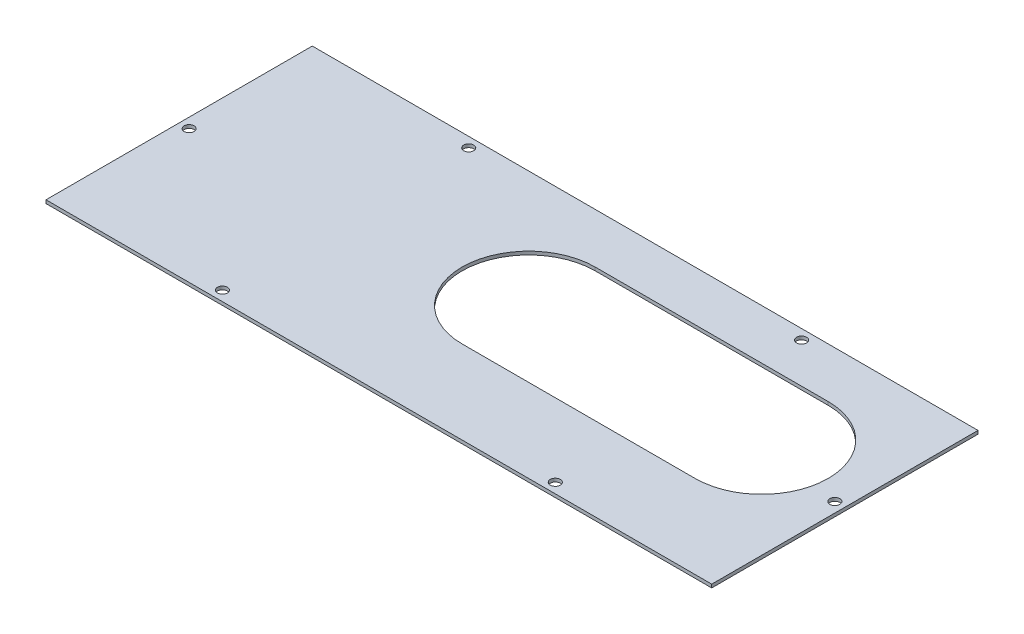
ISO-10303-21;
HEADER;
FILE_DESCRIPTION(('STEP AP214'),'2;1');
FILE_NAME('part.step','',(''),(''),'','','');
FILE_SCHEMA(('AUTOMOTIVE_DESIGN { 1 0 10303 214 1 1 1 1 }'));
ENDSEC;
DATA;
#1=APPLICATION_CONTEXT('core data for automotive mechanical design processes');
#2=APPLICATION_PROTOCOL_DEFINITION('international standard','automotive_design',2000,#1);
#3=PRODUCT_CONTEXT('',#1,'mechanical');
#4=PRODUCT('Part','Part','',(#3));
#5=PRODUCT_RELATED_PRODUCT_CATEGORY('part','',(#4));
#6=PRODUCT_DEFINITION_FORMATION('','',#4);
#7=PRODUCT_DEFINITION_CONTEXT('part definition',#1,'design');
#8=PRODUCT_DEFINITION('design','',#6,#7);
#9=PRODUCT_DEFINITION_SHAPE('','',#8);
#10=(LENGTH_UNIT() NAMED_UNIT(*) SI_UNIT(.MILLI.,.METRE.));
#11=(NAMED_UNIT(*) PLANE_ANGLE_UNIT() SI_UNIT($,.RADIAN.));
#12=(NAMED_UNIT(*) SI_UNIT($,.STERADIAN.) SOLID_ANGLE_UNIT());
#13=UNCERTAINTY_MEASURE_WITH_UNIT(LENGTH_MEASURE(1.E-05),#10,'distance_accuracy_value','');
#14=(GEOMETRIC_REPRESENTATION_CONTEXT(3) GLOBAL_UNCERTAINTY_ASSIGNED_CONTEXT((#13)) GLOBAL_UNIT_ASSIGNED_CONTEXT((#10,
#11,#12)) REPRESENTATION_CONTEXT('',''));
#15=CARTESIAN_POINT('',(0.,0.,0.));
#16=DIRECTION('',(0.,0.,1.));
#17=DIRECTION('',(1.,0.,0.));
#18=AXIS2_PLACEMENT_3D('',#15,#16,#17);
#19=CARTESIAN_POINT('',(-100.,1.,-40.));
#20=DIRECTION('',(1.,0.,0.));
#21=DIRECTION('',(0.,0.,-1.));
#22=AXIS2_PLACEMENT_3D('',#19,#20,#21);
#23=PLANE('',#22);
#24=DIRECTION('',(0.,0.,1.));
#25=VECTOR('',#24,1.);
#26=CARTESIAN_POINT('',(-100.,0.,-40.));
#27=LINE('',#26,#25);
#28=CARTESIAN_POINT('',(-100.,0.,-40.));
#29=VERTEX_POINT('',#28);
#30=CARTESIAN_POINT('',(-100.,0.,40.));
#31=VERTEX_POINT('',#30);
#32=EDGE_CURVE('E115',#29,#31,#27,.T.);
#33=ORIENTED_EDGE('',*,*,#32,.T.);
#34=DIRECTION('',(0.,-1.,0.));
#35=VECTOR('',#34,1.);
#36=CARTESIAN_POINT('',(-100.,1.,40.));
#37=LINE('',#36,#35);
#38=CARTESIAN_POINT('',(-100.,1.,40.));
#39=VERTEX_POINT('',#38);
#40=EDGE_CURVE('E11',#39,#31,#37,.T.);
#41=ORIENTED_EDGE('',*,*,#40,.F.);
#42=DIRECTION('',(0.,0.,1.));
#43=VECTOR('',#42,1.);
#44=CARTESIAN_POINT('',(-100.,1.,-40.));
#45=LINE('',#44,#43);
#46=CARTESIAN_POINT('',(-100.,1.,-40.));
#47=VERTEX_POINT('',#46);
#48=EDGE_CURVE('E138',#47,#39,#45,.T.);
#49=ORIENTED_EDGE('',*,*,#48,.F.);
#50=DIRECTION('',(0.,-1.,0.));
#51=VECTOR('',#50,1.);
#52=CARTESIAN_POINT('',(-100.,1.,-40.));
#53=LINE('',#52,#51);
#54=EDGE_CURVE('E148',#47,#29,#53,.T.);
#55=ORIENTED_EDGE('',*,*,#54,.T.);
#56=EDGE_LOOP('',(#33,#41,#49,#55));
#57=FACE_BOUND('',#56,.T.);
#58=ADVANCED_FACE('F35',(#57),#23,.F.);
#59=CARTESIAN_POINT('',(-100.,1.,40.));
#60=DIRECTION('',(0.,0.,-1.));
#61=DIRECTION('',(-1.,0.,0.));
#62=AXIS2_PLACEMENT_3D('',#59,#60,#61);
#63=PLANE('',#62);
#64=DIRECTION('',(1.,0.,0.));
#65=VECTOR('',#64,1.);
#66=CARTESIAN_POINT('',(-100.,0.,40.));
#67=LINE('',#66,#65);
#68=CARTESIAN_POINT('',(100.,0.,40.));
#69=VERTEX_POINT('',#68);
#70=EDGE_CURVE('E151',#31,#69,#67,.T.);
#71=ORIENTED_EDGE('',*,*,#70,.T.);
#72=DIRECTION('',(0.,-1.,0.));
#73=VECTOR('',#72,1.);
#74=CARTESIAN_POINT('',(100.,1.,40.));
#75=LINE('',#74,#73);
#76=CARTESIAN_POINT('',(100.,1.,40.));
#77=VERTEX_POINT('',#76);
#78=EDGE_CURVE('E43',#77,#69,#75,.T.);
#79=ORIENTED_EDGE('',*,*,#78,.F.);
#80=DIRECTION('',(1.,0.,0.));
#81=VECTOR('',#80,1.);
#82=CARTESIAN_POINT('',(-100.,1.,40.));
#83=LINE('',#82,#81);
#84=EDGE_CURVE('E141',#39,#77,#83,.T.);
#85=ORIENTED_EDGE('',*,*,#84,.F.);
#86=ORIENTED_EDGE('',*,*,#40,.T.);
#87=EDGE_LOOP('',(#71,#79,#85,#86));
#88=FACE_BOUND('',#87,.T.);
#89=ADVANCED_FACE('F219',(#88),#63,.F.);
#90=CARTESIAN_POINT('',(100.,1.,-40.));
#91=DIRECTION('',(-1.,0.,0.));
#92=DIRECTION('',(0.,0.,1.));
#93=AXIS2_PLACEMENT_3D('',#90,#91,#92);
#94=PLANE('',#93);
#95=DIRECTION('',(0.,0.,-1.));
#96=VECTOR('',#95,1.);
#97=CARTESIAN_POINT('',(100.,0.,-40.));
#98=LINE('',#97,#96);
#99=CARTESIAN_POINT('',(100.,0.,-40.));
#100=VERTEX_POINT('',#99);
#101=EDGE_CURVE('E153',#69,#100,#98,.T.);
#102=ORIENTED_EDGE('',*,*,#101,.T.);
#103=DIRECTION('',(0.,-1.,0.));
#104=VECTOR('',#103,1.);
#105=CARTESIAN_POINT('',(100.,1.,-40.));
#106=LINE('',#105,#104);
#107=CARTESIAN_POINT('',(100.,1.,-40.));
#108=VERTEX_POINT('',#107);
#109=EDGE_CURVE('E158',#108,#100,#106,.T.);
#110=ORIENTED_EDGE('',*,*,#109,.F.);
#111=DIRECTION('',(0.,0.,-1.));
#112=VECTOR('',#111,1.);
#113=CARTESIAN_POINT('',(100.,1.,-40.));
#114=LINE('',#113,#112);
#115=EDGE_CURVE('E144',#77,#108,#114,.T.);
#116=ORIENTED_EDGE('',*,*,#115,.F.);
#117=ORIENTED_EDGE('',*,*,#78,.T.);
#118=EDGE_LOOP('',(#102,#110,#116,#117));
#119=FACE_BOUND('',#118,.T.);
#120=ADVANCED_FACE('F224',(#119),#94,.F.);
#121=CARTESIAN_POINT('',(-100.,1.,-40.));
#122=DIRECTION('',(0.,0.,1.));
#123=DIRECTION('',(1.,0.,0.));
#124=AXIS2_PLACEMENT_3D('',#121,#122,#123);
#125=PLANE('',#124);
#126=DIRECTION('',(-1.,0.,0.));
#127=VECTOR('',#126,1.);
#128=CARTESIAN_POINT('',(-100.,0.,-40.));
#129=LINE('',#128,#127);
#130=EDGE_CURVE('E142',#100,#29,#129,.T.);
#131=ORIENTED_EDGE('',*,*,#130,.T.);
#132=ORIENTED_EDGE('',*,*,#54,.F.);
#133=DIRECTION('',(-1.,0.,0.));
#134=VECTOR('',#133,1.);
#135=CARTESIAN_POINT('',(-100.,1.,-40.));
#136=LINE('',#135,#134);
#137=EDGE_CURVE('E146',#108,#47,#136,.T.);
#138=ORIENTED_EDGE('',*,*,#137,.F.);
#139=ORIENTED_EDGE('',*,*,#109,.T.);
#140=EDGE_LOOP('',(#131,#132,#138,#139));
#141=FACE_BOUND('',#140,.T.);
#142=ADVANCED_FACE('F206',(#141),#125,.F.);
#143=CARTESIAN_POINT('',(0.,1.,0.));
#144=DIRECTION('',(0.,1.,0.));
#145=DIRECTION('',(0.,0.,1.));
#146=AXIS2_PLACEMENT_3D('',#143,#144,#145);
#147=PLANE('',#146);
#148=CARTESIAN_POINT('',(97.,1.,0.));
#149=DIRECTION('',(0.,1.,0.));
#150=DIRECTION('',(0.,0.,1.));
#151=AXIS2_PLACEMENT_3D('',#148,#149,#150);
#152=CIRCLE('',#151,1.5);
#153=CARTESIAN_POINT('',(97.,1.,1.5));
#154=VERTEX_POINT('',#153);
#155=EDGE_CURVE('E190',#154,#154,#152,.T.);
#156=ORIENTED_EDGE('',*,*,#155,.F.);
#157=EDGE_LOOP('',(#156));
#158=FACE_BOUND('',#157,.T.);
#159=CARTESIAN_POINT('',(-97.,1.,0.));
#160=DIRECTION('',(0.,1.,0.));
#161=DIRECTION('',(0.,0.,1.));
#162=AXIS2_PLACEMENT_3D('',#159,#160,#161);
#163=CIRCLE('',#162,1.5);
#164=CARTESIAN_POINT('',(-97.,1.,1.5));
#165=VERTEX_POINT('',#164);
#166=EDGE_CURVE('E180',#165,#165,#163,.T.);
#167=ORIENTED_EDGE('',*,*,#166,.F.);
#168=EDGE_LOOP('',(#167));
#169=FACE_BOUND('',#168,.T.);
#170=CARTESIAN_POINT('',(-50.,1.,37.));
#171=DIRECTION('',(0.,1.,0.));
#172=DIRECTION('',(0.,0.,1.));
#173=AXIS2_PLACEMENT_3D('',#170,#171,#172);
#174=CIRCLE('',#173,1.5);
#175=CARTESIAN_POINT('',(-50.,1.,38.5));
#176=VERTEX_POINT('',#175);
#177=EDGE_CURVE('E177',#176,#176,#174,.T.);
#178=ORIENTED_EDGE('',*,*,#177,.F.);
#179=EDGE_LOOP('',(#178));
#180=FACE_BOUND('',#179,.T.);
#181=CARTESIAN_POINT('',(50.,1.,37.));
#182=DIRECTION('',(0.,1.,0.));
#183=DIRECTION('',(0.,0.,1.));
#184=AXIS2_PLACEMENT_3D('',#181,#182,#183);
#185=CIRCLE('',#184,1.5);
#186=CARTESIAN_POINT('',(50.,1.,38.5));
#187=VERTEX_POINT('',#186);
#188=EDGE_CURVE('E174',#187,#187,#185,.T.);
#189=ORIENTED_EDGE('',*,*,#188,.F.);
#190=EDGE_LOOP('',(#189));
#191=FACE_BOUND('',#190,.T.);
#192=CARTESIAN_POINT('',(50.,1.,-37.));
#193=DIRECTION('',(0.,1.,0.));
#194=DIRECTION('',(0.,0.,1.));
#195=AXIS2_PLACEMENT_3D('',#192,#193,#194);
#196=CIRCLE('',#195,1.5);
#197=CARTESIAN_POINT('',(50.,1.,-35.5));
#198=VERTEX_POINT('',#197);
#199=EDGE_CURVE('E170',#198,#198,#196,.T.);
#200=ORIENTED_EDGE('',*,*,#199,.F.);
#201=EDGE_LOOP('',(#200));
#202=FACE_BOUND('',#201,.T.);
#203=CARTESIAN_POINT('',(-50.,1.,-37.));
#204=DIRECTION('',(0.,1.,0.));
#205=DIRECTION('',(0.,0.,1.));
#206=AXIS2_PLACEMENT_3D('',#203,#204,#205);
#207=CIRCLE('',#206,1.5);
#208=CARTESIAN_POINT('',(-50.,1.,-35.5));
#209=VERTEX_POINT('',#208);
#210=EDGE_CURVE('E166',#209,#209,#207,.T.);
#211=ORIENTED_EDGE('',*,*,#210,.F.);
#212=EDGE_LOOP('',(#211));
#213=FACE_BOUND('',#212,.T.);
#214=CARTESIAN_POINT('',(0.,1.,-5.));
#215=DIRECTION('',(0.,1.,0.));
#216=DIRECTION('',(0.,0.,1.));
#217=AXIS2_PLACEMENT_3D('',#214,#215,#216);
#218=CIRCLE('',#217,20.);
#219=CARTESIAN_POINT('',(0.,1.,-25.));
#220=VERTEX_POINT('',#219);
#221=CARTESIAN_POINT('',(0.,1.,15.));
#222=VERTEX_POINT('',#221);
#223=EDGE_CURVE('E51',#220,#222,#218,.T.);
#224=ORIENTED_EDGE('',*,*,#223,.F.);
#225=DIRECTION('',(-1.,0.,0.));
#226=VECTOR('',#225,1.);
#227=CARTESIAN_POINT('',(0.,1.,-25.));
#228=LINE('',#227,#226);
#229=CARTESIAN_POINT('',(70.,1.,-25.));
#230=VERTEX_POINT('',#229);
#231=EDGE_CURVE('E109',#230,#220,#228,.T.);
#232=ORIENTED_EDGE('',*,*,#231,.F.);
#233=CARTESIAN_POINT('',(70.,1.,-5.));
#234=DIRECTION('',(0.,1.,0.));
#235=DIRECTION('',(0.,0.,1.));
#236=AXIS2_PLACEMENT_3D('',#233,#234,#235);
#237=CIRCLE('',#236,20.);
#238=CARTESIAN_POINT('',(70.,1.,15.));
#239=VERTEX_POINT('',#238);
#240=EDGE_CURVE('E129',#239,#230,#237,.T.);
#241=ORIENTED_EDGE('',*,*,#240,.F.);
#242=DIRECTION('',(1.,0.,0.));
#243=VECTOR('',#242,1.);
#244=CARTESIAN_POINT('',(0.,1.,15.));
#245=LINE('',#244,#243);
#246=EDGE_CURVE('E123',#222,#239,#245,.T.);
#247=ORIENTED_EDGE('',*,*,#246,.F.);
#248=EDGE_LOOP('',(#224,#232,#241,#247));
#249=FACE_BOUND('',#248,.T.);
#250=ORIENTED_EDGE('',*,*,#48,.T.);
#251=ORIENTED_EDGE('',*,*,#84,.T.);
#252=ORIENTED_EDGE('',*,*,#115,.T.);
#253=ORIENTED_EDGE('',*,*,#137,.T.);
#254=EDGE_LOOP('',(#250,#251,#252,#253));
#255=FACE_BOUND('',#254,.T.);
#256=ADVANCED_FACE('F203',(#158,#169,#180,#191,#202,#213,#249,#255),#147,.T.);
#257=CARTESIAN_POINT('',(0.,0.,0.));
#258=DIRECTION('',(0.,1.,0.));
#259=DIRECTION('',(0.,0.,1.));
#260=AXIS2_PLACEMENT_3D('',#257,#258,#259);
#261=PLANE('',#260);
#262=CARTESIAN_POINT('',(97.,0.,0.));
#263=DIRECTION('',(0.,1.,0.));
#264=DIRECTION('',(0.,0.,1.));
#265=AXIS2_PLACEMENT_3D('',#262,#263,#264);
#266=CIRCLE('',#265,1.5);
#267=CARTESIAN_POINT('',(97.,0.,1.5));
#268=VERTEX_POINT('',#267);
#269=EDGE_CURVE('E38',#268,#268,#266,.T.);
#270=ORIENTED_EDGE('',*,*,#269,.T.);
#271=EDGE_LOOP('',(#270));
#272=FACE_BOUND('',#271,.T.);
#273=CARTESIAN_POINT('',(-97.,0.,0.));
#274=DIRECTION('',(0.,1.,0.));
#275=DIRECTION('',(0.,0.,1.));
#276=AXIS2_PLACEMENT_3D('',#273,#274,#275);
#277=CIRCLE('',#276,1.5);
#278=CARTESIAN_POINT('',(-97.,0.,1.5));
#279=VERTEX_POINT('',#278);
#280=EDGE_CURVE('E178',#279,#279,#277,.T.);
#281=ORIENTED_EDGE('',*,*,#280,.T.);
#282=EDGE_LOOP('',(#281));
#283=FACE_BOUND('',#282,.T.);
#284=CARTESIAN_POINT('',(-50.,0.,37.));
#285=DIRECTION('',(0.,1.,0.));
#286=DIRECTION('',(0.,0.,1.));
#287=AXIS2_PLACEMENT_3D('',#284,#285,#286);
#288=CIRCLE('',#287,1.5);
#289=CARTESIAN_POINT('',(-50.,0.,38.5));
#290=VERTEX_POINT('',#289);
#291=EDGE_CURVE('E175',#290,#290,#288,.T.);
#292=ORIENTED_EDGE('',*,*,#291,.T.);
#293=EDGE_LOOP('',(#292));
#294=FACE_BOUND('',#293,.T.);
#295=CARTESIAN_POINT('',(50.,0.,37.));
#296=DIRECTION('',(0.,1.,0.));
#297=DIRECTION('',(0.,0.,1.));
#298=AXIS2_PLACEMENT_3D('',#295,#296,#297);
#299=CIRCLE('',#298,1.5);
#300=CARTESIAN_POINT('',(50.,0.,38.5));
#301=VERTEX_POINT('',#300);
#302=EDGE_CURVE('E171',#301,#301,#299,.T.);
#303=ORIENTED_EDGE('',*,*,#302,.T.);
#304=EDGE_LOOP('',(#303));
#305=FACE_BOUND('',#304,.T.);
#306=CARTESIAN_POINT('',(50.,0.,-37.));
#307=DIRECTION('',(0.,1.,0.));
#308=DIRECTION('',(0.,0.,1.));
#309=AXIS2_PLACEMENT_3D('',#306,#307,#308);
#310=CIRCLE('',#309,1.5);
#311=CARTESIAN_POINT('',(50.,0.,-35.5));
#312=VERTEX_POINT('',#311);
#313=EDGE_CURVE('E167',#312,#312,#310,.T.);
#314=ORIENTED_EDGE('',*,*,#313,.T.);
#315=EDGE_LOOP('',(#314));
#316=FACE_BOUND('',#315,.T.);
#317=CARTESIAN_POINT('',(-50.,0.,-37.));
#318=DIRECTION('',(0.,1.,0.));
#319=DIRECTION('',(0.,0.,1.));
#320=AXIS2_PLACEMENT_3D('',#317,#318,#319);
#321=CIRCLE('',#320,1.5);
#322=CARTESIAN_POINT('',(-50.,0.,-35.5));
#323=VERTEX_POINT('',#322);
#324=EDGE_CURVE('E163',#323,#323,#321,.T.);
#325=ORIENTED_EDGE('',*,*,#324,.T.);
#326=EDGE_LOOP('',(#325));
#327=FACE_BOUND('',#326,.T.);
#328=DIRECTION('',(1.,0.,0.));
#329=VECTOR('',#328,1.);
#330=CARTESIAN_POINT('',(0.,0.,-25.));
#331=LINE('',#330,#329);
#332=CARTESIAN_POINT('',(0.,0.,-25.));
#333=VERTEX_POINT('',#332);
#334=CARTESIAN_POINT('',(70.,0.,-25.));
#335=VERTEX_POINT('',#334);
#336=EDGE_CURVE('E121',#333,#335,#331,.T.);
#337=ORIENTED_EDGE('',*,*,#336,.F.);
#338=CARTESIAN_POINT('',(0.,0.,-5.));
#339=DIRECTION('',(0.,1.,0.));
#340=DIRECTION('',(0.,0.,1.));
#341=AXIS2_PLACEMENT_3D('',#338,#339,#340);
#342=CIRCLE('',#341,20.);
#343=CARTESIAN_POINT('',(0.,0.,15.));
#344=VERTEX_POINT('',#343);
#345=EDGE_CURVE('E103',#344,#333,#342,.F.);
#346=ORIENTED_EDGE('',*,*,#345,.F.);
#347=DIRECTION('',(-1.,0.,0.));
#348=VECTOR('',#347,1.);
#349=CARTESIAN_POINT('',(0.,0.,15.));
#350=LINE('',#349,#348);
#351=CARTESIAN_POINT('',(70.,0.,15.));
#352=VERTEX_POINT('',#351);
#353=EDGE_CURVE('E112',#352,#344,#350,.T.);
#354=ORIENTED_EDGE('',*,*,#353,.F.);
#355=CARTESIAN_POINT('',(70.,0.,-5.));
#356=DIRECTION('',(0.,1.,0.));
#357=DIRECTION('',(0.,0.,1.));
#358=AXIS2_PLACEMENT_3D('',#355,#356,#357);
#359=CIRCLE('',#358,20.);
#360=EDGE_CURVE('E59',#335,#352,#359,.F.);
#361=ORIENTED_EDGE('',*,*,#360,.F.);
#362=EDGE_LOOP('',(#337,#346,#354,#361));
#363=FACE_BOUND('',#362,.T.);
#364=ORIENTED_EDGE('',*,*,#32,.F.);
#365=ORIENTED_EDGE('',*,*,#130,.F.);
#366=ORIENTED_EDGE('',*,*,#101,.F.);
#367=ORIENTED_EDGE('',*,*,#70,.F.);
#368=EDGE_LOOP('',(#364,#365,#366,#367));
#369=FACE_BOUND('',#368,.T.);
#370=ADVANCED_FACE('F118',(#272,#283,#294,#305,#316,#327,#363,#369),#261,.F.);
#371=CARTESIAN_POINT('',(0.,-0.000999999999999916,-5.));
#372=DIRECTION('',(0.,1.,0.));
#373=DIRECTION('',(0.,0.,1.));
#374=AXIS2_PLACEMENT_3D('',#371,#372,#373);
#375=CYLINDRICAL_SURFACE('',#374,20.);
#376=ORIENTED_EDGE('',*,*,#345,.T.);
#377=DIRECTION('',(0.,1.,0.));
#378=VECTOR('',#377,1.);
#379=CARTESIAN_POINT('',(0.,-0.000999999999999916,-25.));
#380=LINE('',#379,#378);
#381=EDGE_CURVE('E116',#333,#220,#380,.T.);
#382=ORIENTED_EDGE('',*,*,#381,.T.);
#383=ORIENTED_EDGE('',*,*,#223,.T.);
#384=DIRECTION('',(0.,1.,0.));
#385=VECTOR('',#384,1.);
#386=CARTESIAN_POINT('',(0.,-0.000999999999999916,15.));
#387=LINE('',#386,#385);
#388=EDGE_CURVE('E99',#344,#222,#387,.T.);
#389=ORIENTED_EDGE('',*,*,#388,.F.);
#390=EDGE_LOOP('',(#376,#382,#383,#389));
#391=FACE_BOUND('',#390,.T.);
#392=ADVANCED_FACE('F101',(#391),#375,.F.);
#393=CARTESIAN_POINT('',(0.,-0.000999999999999916,-25.));
#394=DIRECTION('',(0.,0.,-1.));
#395=DIRECTION('',(-1.,0.,0.));
#396=AXIS2_PLACEMENT_3D('',#393,#394,#395);
#397=PLANE('',#396);
#398=ORIENTED_EDGE('',*,*,#336,.T.);
#399=DIRECTION('',(0.,1.,0.));
#400=VECTOR('',#399,1.);
#401=CARTESIAN_POINT('',(70.,-0.000999999999999916,-25.));
#402=LINE('',#401,#400);
#403=EDGE_CURVE('E135',#335,#230,#402,.T.);
#404=ORIENTED_EDGE('',*,*,#403,.T.);
#405=ORIENTED_EDGE('',*,*,#231,.T.);
#406=ORIENTED_EDGE('',*,*,#381,.F.);
#407=EDGE_LOOP('',(#398,#404,#405,#406));
#408=FACE_BOUND('',#407,.T.);
#409=ADVANCED_FACE('F234',(#408),#397,.F.);
#410=CARTESIAN_POINT('',(70.,-0.000999999999999916,-5.));
#411=DIRECTION('',(0.,1.,0.));
#412=DIRECTION('',(0.,0.,1.));
#413=AXIS2_PLACEMENT_3D('',#410,#411,#412);
#414=CYLINDRICAL_SURFACE('',#413,20.);
#415=ORIENTED_EDGE('',*,*,#360,.T.);
#416=DIRECTION('',(0.,1.,0.));
#417=VECTOR('',#416,1.);
#418=CARTESIAN_POINT('',(70.,-0.000999999999999916,15.));
#419=LINE('',#418,#417);
#420=EDGE_CURVE('E108',#352,#239,#419,.T.);
#421=ORIENTED_EDGE('',*,*,#420,.T.);
#422=ORIENTED_EDGE('',*,*,#240,.T.);
#423=ORIENTED_EDGE('',*,*,#403,.F.);
#424=EDGE_LOOP('',(#415,#421,#422,#423));
#425=FACE_BOUND('',#424,.T.);
#426=ADVANCED_FACE('F271',(#425),#414,.F.);
#427=CARTESIAN_POINT('',(0.,-0.000999999999999916,15.));
#428=DIRECTION('',(0.,0.,1.));
#429=DIRECTION('',(1.,0.,0.));
#430=AXIS2_PLACEMENT_3D('',#427,#428,#429);
#431=PLANE('',#430);
#432=ORIENTED_EDGE('',*,*,#353,.T.);
#433=ORIENTED_EDGE('',*,*,#388,.T.);
#434=ORIENTED_EDGE('',*,*,#246,.T.);
#435=ORIENTED_EDGE('',*,*,#420,.F.);
#436=EDGE_LOOP('',(#432,#433,#434,#435));
#437=FACE_BOUND('',#436,.T.);
#438=ADVANCED_FACE('F113',(#437),#431,.F.);
#439=CARTESIAN_POINT('',(-50.,-9.,-37.));
#440=DIRECTION('',(0.,1.,0.));
#441=DIRECTION('',(0.,0.,1.));
#442=AXIS2_PLACEMENT_3D('',#439,#440,#441);
#443=CYLINDRICAL_SURFACE('',#442,1.5);
#444=ORIENTED_EDGE('',*,*,#210,.T.);
#445=EDGE_LOOP('',(#444));
#446=FACE_BOUND('',#445,.T.);
#447=ORIENTED_EDGE('',*,*,#324,.F.);
#448=EDGE_LOOP('',(#447));
#449=FACE_BOUND('',#448,.T.);
#450=ADVANCED_FACE('F200',(#446,#449),#443,.F.);
#451=CARTESIAN_POINT('',(50.,-9.,-37.));
#452=DIRECTION('',(0.,1.,0.));
#453=DIRECTION('',(0.,0.,1.));
#454=AXIS2_PLACEMENT_3D('',#451,#452,#453);
#455=CYLINDRICAL_SURFACE('',#454,1.5);
#456=ORIENTED_EDGE('',*,*,#199,.T.);
#457=EDGE_LOOP('',(#456));
#458=FACE_BOUND('',#457,.T.);
#459=ORIENTED_EDGE('',*,*,#313,.F.);
#460=EDGE_LOOP('',(#459));
#461=FACE_BOUND('',#460,.T.);
#462=ADVANCED_FACE('F289',(#458,#461),#455,.F.);
#463=CARTESIAN_POINT('',(50.,-9.,37.));
#464=DIRECTION('',(0.,1.,0.));
#465=DIRECTION('',(0.,0.,1.));
#466=AXIS2_PLACEMENT_3D('',#463,#464,#465);
#467=CYLINDRICAL_SURFACE('',#466,1.5);
#468=ORIENTED_EDGE('',*,*,#188,.T.);
#469=EDGE_LOOP('',(#468));
#470=FACE_BOUND('',#469,.T.);
#471=ORIENTED_EDGE('',*,*,#302,.F.);
#472=EDGE_LOOP('',(#471));
#473=FACE_BOUND('',#472,.T.);
#474=ADVANCED_FACE('F296',(#470,#473),#467,.F.);
#475=CARTESIAN_POINT('',(-50.,-9.,37.));
#476=DIRECTION('',(0.,1.,0.));
#477=DIRECTION('',(0.,0.,1.));
#478=AXIS2_PLACEMENT_3D('',#475,#476,#477);
#479=CYLINDRICAL_SURFACE('',#478,1.5);
#480=ORIENTED_EDGE('',*,*,#177,.T.);
#481=EDGE_LOOP('',(#480));
#482=FACE_BOUND('',#481,.T.);
#483=ORIENTED_EDGE('',*,*,#291,.F.);
#484=EDGE_LOOP('',(#483));
#485=FACE_BOUND('',#484,.T.);
#486=ADVANCED_FACE('F304',(#482,#485),#479,.F.);
#487=CARTESIAN_POINT('',(-97.,-9.,0.));
#488=DIRECTION('',(0.,1.,0.));
#489=DIRECTION('',(0.,0.,1.));
#490=AXIS2_PLACEMENT_3D('',#487,#488,#489);
#491=CYLINDRICAL_SURFACE('',#490,1.5);
#492=ORIENTED_EDGE('',*,*,#166,.T.);
#493=EDGE_LOOP('',(#492));
#494=FACE_BOUND('',#493,.T.);
#495=ORIENTED_EDGE('',*,*,#280,.F.);
#496=EDGE_LOOP('',(#495));
#497=FACE_BOUND('',#496,.T.);
#498=ADVANCED_FACE('F312',(#494,#497),#491,.F.);
#499=CARTESIAN_POINT('',(97.,-9.,0.));
#500=DIRECTION('',(0.,1.,0.));
#501=DIRECTION('',(0.,0.,1.));
#502=AXIS2_PLACEMENT_3D('',#499,#500,#501);
#503=CYLINDRICAL_SURFACE('',#502,1.5);
#504=ORIENTED_EDGE('',*,*,#155,.T.);
#505=EDGE_LOOP('',(#504));
#506=FACE_BOUND('',#505,.T.);
#507=ORIENTED_EDGE('',*,*,#269,.F.);
#508=EDGE_LOOP('',(#507));
#509=FACE_BOUND('',#508,.T.);
#510=ADVANCED_FACE('F320',(#506,#509),#503,.F.);
#511=CLOSED_SHELL('',(#58,#89,#120,#142,#256,#370,#392,#409,#426,#438,#450,#462,#474,#486,#498,#510));
#512=MANIFOLD_SOLID_BREP('B2',#511);
#513=ADVANCED_BREP_SHAPE_REPRESENTATION('',(#18,#512),#14);
#514=SHAPE_DEFINITION_REPRESENTATION(#9,#513);
ENDSEC;
END-ISO-10303-21;
